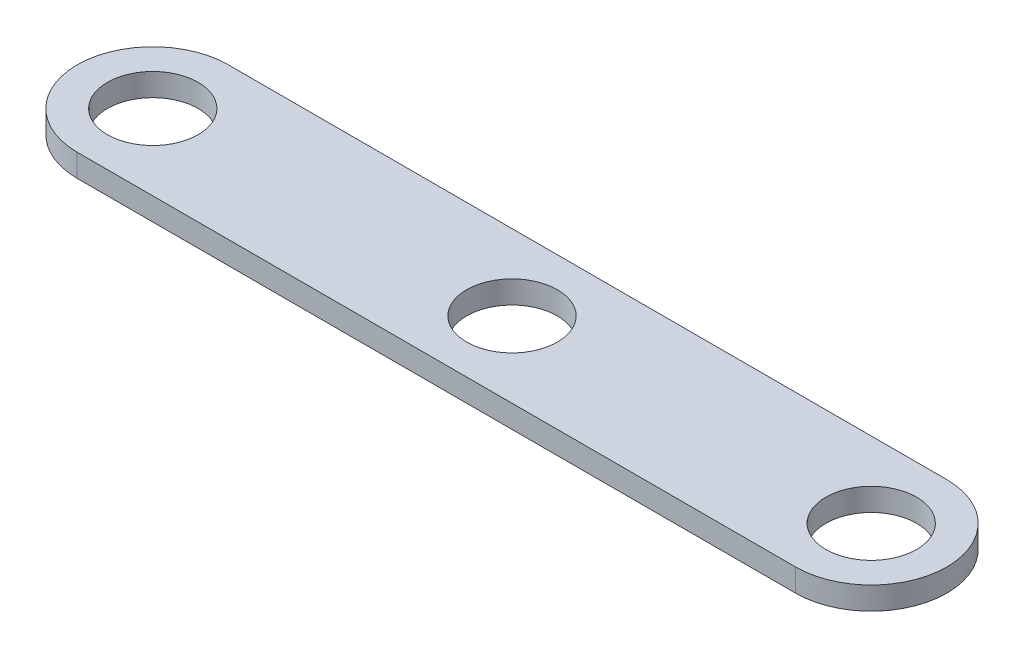
ISO-10303-21;
HEADER;
FILE_DESCRIPTION(('STEP AP214'),'2;1');
FILE_NAME('part.step','',(''),(''),'','','');
FILE_SCHEMA(('AUTOMOTIVE_DESIGN { 1 0 10303 214 1 1 1 1 }'));
ENDSEC;
DATA;
#1=APPLICATION_CONTEXT('core data for automotive mechanical design processes');
#2=APPLICATION_PROTOCOL_DEFINITION('international standard','automotive_design',2000,#1);
#3=PRODUCT_CONTEXT('',#1,'mechanical');
#4=PRODUCT('Part','Part','',(#3));
#5=PRODUCT_RELATED_PRODUCT_CATEGORY('part','',(#4));
#6=PRODUCT_DEFINITION_FORMATION('','',#4);
#7=PRODUCT_DEFINITION_CONTEXT('part definition',#1,'design');
#8=PRODUCT_DEFINITION('design','',#6,#7);
#9=PRODUCT_DEFINITION_SHAPE('','',#8);
#10=(LENGTH_UNIT() NAMED_UNIT(*) SI_UNIT(.MILLI.,.METRE.));
#11=(NAMED_UNIT(*) PLANE_ANGLE_UNIT() SI_UNIT($,.RADIAN.));
#12=(NAMED_UNIT(*) SI_UNIT($,.STERADIAN.) SOLID_ANGLE_UNIT());
#13=UNCERTAINTY_MEASURE_WITH_UNIT(LENGTH_MEASURE(1.E-05),#10,'distance_accuracy_value','');
#14=(GEOMETRIC_REPRESENTATION_CONTEXT(3) GLOBAL_UNCERTAINTY_ASSIGNED_CONTEXT((#13)) GLOBAL_UNIT_ASSIGNED_CONTEXT((#10,
#11,#12)) REPRESENTATION_CONTEXT('',''));
#15=CARTESIAN_POINT('',(0.,0.,0.));
#16=DIRECTION('',(0.,0.,1.));
#17=DIRECTION('',(1.,0.,0.));
#18=AXIS2_PLACEMENT_3D('',#15,#16,#17);
#19=CARTESIAN_POINT('',(-7.09255665925721,3.,-9.32692307692308));
#20=DIRECTION('',(0.,1.,0.));
#21=DIRECTION('',(0.,0.,1.));
#22=AXIS2_PLACEMENT_3D('',#19,#20,#21);
#23=PLANE('',#22);
#24=CARTESIAN_POINT('',(40.4074433407428,3.,-9.32692307692308));
#25=DIRECTION('',(0.,1.,0.));
#26=DIRECTION('',(0.,0.,1.));
#27=AXIS2_PLACEMENT_3D('',#24,#25,#26);
#28=CIRCLE('',#27,6.);
#29=CARTESIAN_POINT('',(40.4074433407428,3.,-3.32692307692308));
#30=VERTEX_POINT('',#29);
#31=EDGE_CURVE('E146',#30,#30,#28,.T.);
#32=ORIENTED_EDGE('',*,*,#31,.F.);
#33=EDGE_LOOP('',(#32));
#34=FACE_BOUND('',#33,.T.);
#35=CARTESIAN_POINT('',(-7.09255665925721,3.,-9.32692307692308));
#36=DIRECTION('',(0.,1.,0.));
#37=DIRECTION('',(0.,0.,1.));
#38=AXIS2_PLACEMENT_3D('',#35,#36,#37);
#39=CIRCLE('',#38,6.);
#40=CARTESIAN_POINT('',(-7.09255665925721,3.,-3.32692307692308));
#41=VERTEX_POINT('',#40);
#42=EDGE_CURVE('E112',#41,#41,#39,.T.);
#43=ORIENTED_EDGE('',*,*,#42,.F.);
#44=EDGE_LOOP('',(#43));
#45=FACE_BOUND('',#44,.T.);
#46=CARTESIAN_POINT('',(-7.09255665925721,3.,-9.32692307692308));
#47=DIRECTION('',(0.,1.,0.));
#48=DIRECTION('',(0.,0.,1.));
#49=AXIS2_PLACEMENT_3D('',#46,#47,#48);
#50=CIRCLE('',#49,10.);
#51=CARTESIAN_POINT('',(-7.09255665925721,3.,-19.3269230769231));
#52=VERTEX_POINT('',#51);
#53=CARTESIAN_POINT('',(-7.09255665925721,3.,0.673076923076923));
#54=VERTEX_POINT('',#53);
#55=EDGE_CURVE('E92',#52,#54,#50,.T.);
#56=ORIENTED_EDGE('',*,*,#55,.T.);
#57=DIRECTION('',(1.,0.,0.));
#58=VECTOR('',#57,1.);
#59=CARTESIAN_POINT('',(-7.09255665925721,3.,0.673076923076923));
#60=LINE('',#59,#58);
#61=CARTESIAN_POINT('',(87.9074433407428,3.,0.673076923076922));
#62=VERTEX_POINT('',#61);
#63=EDGE_CURVE('E87',#54,#62,#60,.T.);
#64=ORIENTED_EDGE('',*,*,#63,.T.);
#65=CARTESIAN_POINT('',(87.9074433407428,3.,-9.32692307692308));
#66=DIRECTION('',(0.,1.,0.));
#67=DIRECTION('',(0.,0.,1.));
#68=AXIS2_PLACEMENT_3D('',#65,#66,#67);
#69=CIRCLE('',#68,10.);
#70=CARTESIAN_POINT('',(87.9074433407428,3.,-19.3269230769231));
#71=VERTEX_POINT('',#70);
#72=EDGE_CURVE('E90',#62,#71,#69,.T.);
#73=ORIENTED_EDGE('',*,*,#72,.T.);
#74=DIRECTION('',(-1.,0.,0.));
#75=VECTOR('',#74,1.);
#76=CARTESIAN_POINT('',(-7.09255665925721,3.,-19.3269230769231));
#77=LINE('',#76,#75);
#78=EDGE_CURVE('E57',#71,#52,#77,.T.);
#79=ORIENTED_EDGE('',*,*,#78,.T.);
#80=EDGE_LOOP('',(#56,#64,#73,#79));
#81=FACE_BOUND('',#80,.T.);
#82=CARTESIAN_POINT('',(87.9074433407428,3.,-9.32692307692308));
#83=DIRECTION('',(0.,1.,0.));
#84=DIRECTION('',(0.,0.,1.));
#85=AXIS2_PLACEMENT_3D('',#82,#83,#84);
#86=CIRCLE('',#85,6.);
#87=CARTESIAN_POINT('',(87.9074433407428,3.,-3.32692307692308));
#88=VERTEX_POINT('',#87);
#89=EDGE_CURVE('E134',#88,#88,#86,.T.);
#90=ORIENTED_EDGE('',*,*,#89,.F.);
#91=EDGE_LOOP('',(#90));
#92=FACE_BOUND('',#91,.T.);
#93=ADVANCED_FACE('F39',(#34,#45,#81,#92),#23,.T.);
#94=CARTESIAN_POINT('',(-7.09255665925721,0.,-9.32692307692308));
#95=DIRECTION('',(0.,1.,0.));
#96=DIRECTION('',(0.,0.,1.));
#97=AXIS2_PLACEMENT_3D('',#94,#95,#96);
#98=PLANE('',#97);
#99=CARTESIAN_POINT('',(40.4074433407428,0.,-9.32692307692308));
#100=DIRECTION('',(0.,1.,0.));
#101=DIRECTION('',(0.,0.,1.));
#102=AXIS2_PLACEMENT_3D('',#99,#100,#101);
#103=CIRCLE('',#102,6.);
#104=CARTESIAN_POINT('',(40.4074433407428,0.,-3.32692307692308));
#105=VERTEX_POINT('',#104);
#106=EDGE_CURVE('E142',#105,#105,#103,.T.);
#107=ORIENTED_EDGE('',*,*,#106,.T.);
#108=EDGE_LOOP('',(#107));
#109=FACE_BOUND('',#108,.T.);
#110=CARTESIAN_POINT('',(-7.09255665925721,0.,-9.32692307692308));
#111=DIRECTION('',(0.,1.,0.));
#112=DIRECTION('',(0.,0.,1.));
#113=AXIS2_PLACEMENT_3D('',#110,#111,#112);
#114=CIRCLE('',#113,10.);
#115=CARTESIAN_POINT('',(-7.09255665925721,0.,-19.3269230769231));
#116=VERTEX_POINT('',#115);
#117=CARTESIAN_POINT('',(-7.09255665925721,0.,0.673076923076923));
#118=VERTEX_POINT('',#117);
#119=EDGE_CURVE('E108',#116,#118,#114,.T.);
#120=ORIENTED_EDGE('',*,*,#119,.F.);
#121=DIRECTION('',(-1.,0.,0.));
#122=VECTOR('',#121,1.);
#123=CARTESIAN_POINT('',(-7.09255665925721,0.,-19.3269230769231));
#124=LINE('',#123,#122);
#125=CARTESIAN_POINT('',(87.9074433407428,0.,-19.3269230769231));
#126=VERTEX_POINT('',#125);
#127=EDGE_CURVE('E80',#126,#116,#124,.T.);
#128=ORIENTED_EDGE('',*,*,#127,.F.);
#129=CARTESIAN_POINT('',(87.9074433407428,0.,-9.32692307692308));
#130=DIRECTION('',(0.,1.,0.));
#131=DIRECTION('',(0.,0.,1.));
#132=AXIS2_PLACEMENT_3D('',#129,#130,#131);
#133=CIRCLE('',#132,10.);
#134=CARTESIAN_POINT('',(87.9074433407428,0.,0.673076923076922));
#135=VERTEX_POINT('',#134);
#136=EDGE_CURVE('E74',#135,#126,#133,.T.);
#137=ORIENTED_EDGE('',*,*,#136,.F.);
#138=DIRECTION('',(1.,0.,0.));
#139=VECTOR('',#138,1.);
#140=CARTESIAN_POINT('',(-7.09255665925721,0.,0.673076923076923));
#141=LINE('',#140,#139);
#142=EDGE_CURVE('E97',#118,#135,#141,.T.);
#143=ORIENTED_EDGE('',*,*,#142,.F.);
#144=EDGE_LOOP('',(#120,#128,#137,#143));
#145=FACE_BOUND('',#144,.T.);
#146=CARTESIAN_POINT('',(-7.09255665925721,0.,-9.32692307692308));
#147=DIRECTION('',(0.,1.,0.));
#148=DIRECTION('',(0.,0.,1.));
#149=AXIS2_PLACEMENT_3D('',#146,#147,#148);
#150=CIRCLE('',#149,6.);
#151=CARTESIAN_POINT('',(-7.09255665925721,0.,-3.32692307692308));
#152=VERTEX_POINT('',#151);
#153=EDGE_CURVE('E130',#152,#152,#150,.T.);
#154=ORIENTED_EDGE('',*,*,#153,.T.);
#155=EDGE_LOOP('',(#154));
#156=FACE_BOUND('',#155,.T.);
#157=CARTESIAN_POINT('',(87.9074433407428,0.,-9.32692307692308));
#158=DIRECTION('',(0.,1.,0.));
#159=DIRECTION('',(0.,0.,1.));
#160=AXIS2_PLACEMENT_3D('',#157,#158,#159);
#161=CIRCLE('',#160,6.);
#162=CARTESIAN_POINT('',(87.9074433407428,0.,-3.32692307692308));
#163=VERTEX_POINT('',#162);
#164=EDGE_CURVE('E138',#163,#163,#161,.T.);
#165=ORIENTED_EDGE('',*,*,#164,.T.);
#166=EDGE_LOOP('',(#165));
#167=FACE_BOUND('',#166,.T.);
#168=ADVANCED_FACE('F125',(#109,#145,#156,#167),#98,.F.);
#169=CARTESIAN_POINT('',(-7.09255665925721,3.,-9.32692307692308));
#170=DIRECTION('',(0.,-1.,0.));
#171=DIRECTION('',(0.,0.,-1.));
#172=AXIS2_PLACEMENT_3D('',#169,#170,#171);
#173=CYLINDRICAL_SURFACE('',#172,10.);
#174=ORIENTED_EDGE('',*,*,#119,.T.);
#175=DIRECTION('',(0.,-1.,0.));
#176=VECTOR('',#175,1.);
#177=CARTESIAN_POINT('',(-7.09255665925721,3.,0.673076923076923));
#178=LINE('',#177,#176);
#179=EDGE_CURVE('E11',#54,#118,#178,.T.);
#180=ORIENTED_EDGE('',*,*,#179,.F.);
#181=ORIENTED_EDGE('',*,*,#55,.F.);
#182=DIRECTION('',(0.,-1.,0.));
#183=VECTOR('',#182,1.);
#184=CARTESIAN_POINT('',(-7.09255665925721,3.,-19.3269230769231));
#185=LINE('',#184,#183);
#186=EDGE_CURVE('E104',#52,#116,#185,.T.);
#187=ORIENTED_EDGE('',*,*,#186,.T.);
#188=EDGE_LOOP('',(#174,#180,#181,#187));
#189=FACE_BOUND('',#188,.T.);
#190=ADVANCED_FACE('F41',(#189),#173,.T.);
#191=CARTESIAN_POINT('',(-7.09255665925721,3.,0.673076923076923));
#192=DIRECTION('',(0.,0.,-1.));
#193=DIRECTION('',(-1.,0.,0.));
#194=AXIS2_PLACEMENT_3D('',#191,#192,#193);
#195=PLANE('',#194);
#196=ORIENTED_EDGE('',*,*,#142,.T.);
#197=DIRECTION('',(0.,-1.,0.));
#198=VECTOR('',#197,1.);
#199=CARTESIAN_POINT('',(87.9074433407428,3.,0.673076923076922));
#200=LINE('',#199,#198);
#201=EDGE_CURVE('E49',#62,#135,#200,.T.);
#202=ORIENTED_EDGE('',*,*,#201,.F.);
#203=ORIENTED_EDGE('',*,*,#63,.F.);
#204=ORIENTED_EDGE('',*,*,#179,.T.);
#205=EDGE_LOOP('',(#196,#202,#203,#204));
#206=FACE_BOUND('',#205,.T.);
#207=ADVANCED_FACE('F96',(#206),#195,.F.);
#208=CARTESIAN_POINT('',(87.9074433407428,3.,-9.32692307692308));
#209=DIRECTION('',(0.,-1.,0.));
#210=DIRECTION('',(0.,0.,-1.));
#211=AXIS2_PLACEMENT_3D('',#208,#209,#210);
#212=CYLINDRICAL_SURFACE('',#211,10.);
#213=ORIENTED_EDGE('',*,*,#136,.T.);
#214=DIRECTION('',(0.,-1.,0.));
#215=VECTOR('',#214,1.);
#216=CARTESIAN_POINT('',(87.9074433407428,3.,-19.3269230769231));
#217=LINE('',#216,#215);
#218=EDGE_CURVE('E99',#71,#126,#217,.T.);
#219=ORIENTED_EDGE('',*,*,#218,.F.);
#220=ORIENTED_EDGE('',*,*,#72,.F.);
#221=ORIENTED_EDGE('',*,*,#201,.T.);
#222=EDGE_LOOP('',(#213,#219,#220,#221));
#223=FACE_BOUND('',#222,.T.);
#224=ADVANCED_FACE('F100',(#223),#212,.T.);
#225=CARTESIAN_POINT('',(-7.09255665925721,3.,-19.3269230769231));
#226=DIRECTION('',(0.,0.,1.));
#227=DIRECTION('',(1.,0.,0.));
#228=AXIS2_PLACEMENT_3D('',#225,#226,#227);
#229=PLANE('',#228);
#230=ORIENTED_EDGE('',*,*,#127,.T.);
#231=ORIENTED_EDGE('',*,*,#186,.F.);
#232=ORIENTED_EDGE('',*,*,#78,.F.);
#233=ORIENTED_EDGE('',*,*,#218,.T.);
#234=EDGE_LOOP('',(#230,#231,#232,#233));
#235=FACE_BOUND('',#234,.T.);
#236=ADVANCED_FACE('F122',(#235),#229,.F.);
#237=CARTESIAN_POINT('',(-7.09255665925721,3.,-9.32692307692308));
#238=DIRECTION('',(0.,-1.,0.));
#239=DIRECTION('',(0.,0.,-1.));
#240=AXIS2_PLACEMENT_3D('',#237,#238,#239);
#241=CYLINDRICAL_SURFACE('',#240,6.);
#242=ORIENTED_EDGE('',*,*,#42,.T.);
#243=EDGE_LOOP('',(#242));
#244=FACE_BOUND('',#243,.T.);
#245=ORIENTED_EDGE('',*,*,#153,.F.);
#246=EDGE_LOOP('',(#245));
#247=FACE_BOUND('',#246,.T.);
#248=ADVANCED_FACE('F167',(#244,#247),#241,.F.);
#249=CARTESIAN_POINT('',(87.9074433407428,3.,-9.32692307692308));
#250=DIRECTION('',(0.,-1.,0.));
#251=DIRECTION('',(0.,0.,-1.));
#252=AXIS2_PLACEMENT_3D('',#249,#250,#251);
#253=CYLINDRICAL_SURFACE('',#252,6.);
#254=ORIENTED_EDGE('',*,*,#89,.T.);
#255=EDGE_LOOP('',(#254));
#256=FACE_BOUND('',#255,.T.);
#257=ORIENTED_EDGE('',*,*,#164,.F.);
#258=EDGE_LOOP('',(#257));
#259=FACE_BOUND('',#258,.T.);
#260=ADVANCED_FACE('F158',(#256,#259),#253,.F.);
#261=CARTESIAN_POINT('',(40.4074433407428,0.,-9.32692307692308));
#262=DIRECTION('',(0.,1.,0.));
#263=DIRECTION('',(0.,0.,1.));
#264=AXIS2_PLACEMENT_3D('',#261,#262,#263);
#265=CYLINDRICAL_SURFACE('',#264,6.);
#266=ORIENTED_EDGE('',*,*,#106,.F.);
#267=EDGE_LOOP('',(#266));
#268=FACE_BOUND('',#267,.T.);
#269=ORIENTED_EDGE('',*,*,#31,.T.);
#270=EDGE_LOOP('',(#269));
#271=FACE_BOUND('',#270,.T.);
#272=ADVANCED_FACE('F155',(#268,#271),#265,.F.);
#273=CLOSED_SHELL('',(#93,#168,#190,#207,#224,#236,#248,#260,#272));
#274=MANIFOLD_SOLID_BREP('B2',#273);
#275=ADVANCED_BREP_SHAPE_REPRESENTATION('',(#18,#274),#14);
#276=SHAPE_DEFINITION_REPRESENTATION(#9,#275);
ENDSEC;
END-ISO-10303-21;
